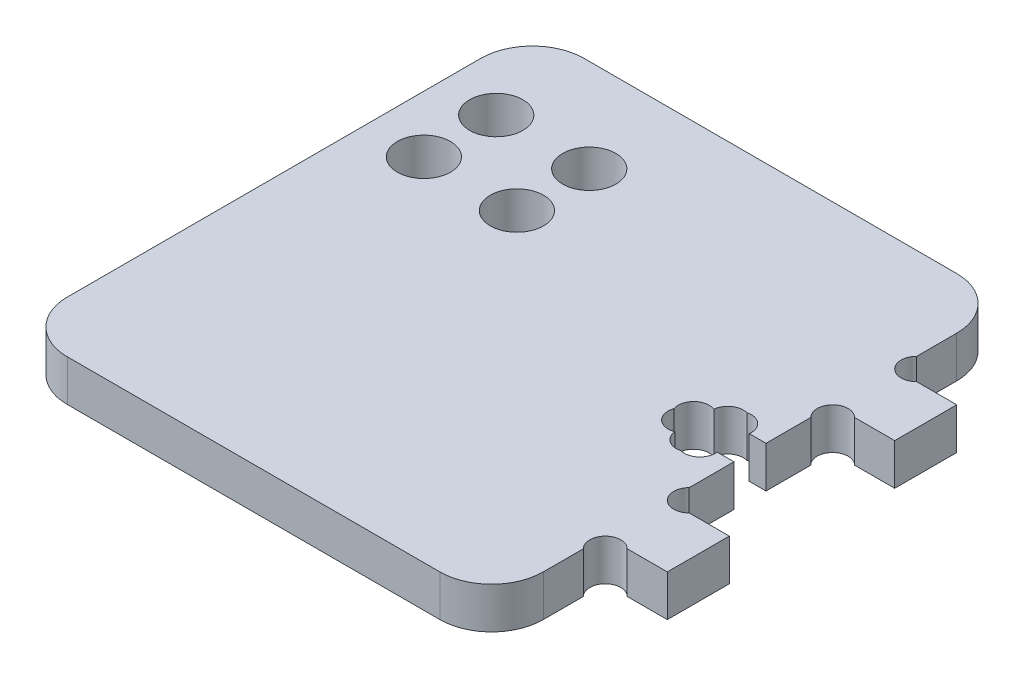
ISO-10303-21;
HEADER;
FILE_DESCRIPTION(('STEP AP214'),'2;1');
FILE_NAME('part.step','',(''),(''),'','','');
FILE_SCHEMA(('AUTOMOTIVE_DESIGN { 1 0 10303 214 1 1 1 1 }'));
ENDSEC;
DATA;
#1=APPLICATION_CONTEXT('core data for automotive mechanical design processes');
#2=APPLICATION_PROTOCOL_DEFINITION('international standard','automotive_design',2000,#1);
#3=PRODUCT_CONTEXT('',#1,'mechanical');
#4=PRODUCT('Part','Part','',(#3));
#5=PRODUCT_RELATED_PRODUCT_CATEGORY('part','',(#4));
#6=PRODUCT_DEFINITION_FORMATION('','',#4);
#7=PRODUCT_DEFINITION_CONTEXT('part definition',#1,'design');
#8=PRODUCT_DEFINITION('design','',#6,#7);
#9=PRODUCT_DEFINITION_SHAPE('','',#8);
#10=(LENGTH_UNIT() NAMED_UNIT(*) SI_UNIT(.MILLI.,.METRE.));
#11=(NAMED_UNIT(*) PLANE_ANGLE_UNIT() SI_UNIT($,.RADIAN.));
#12=(NAMED_UNIT(*) SI_UNIT($,.STERADIAN.) SOLID_ANGLE_UNIT());
#13=UNCERTAINTY_MEASURE_WITH_UNIT(LENGTH_MEASURE(1.E-05),#10,'distance_accuracy_value','');
#14=(GEOMETRIC_REPRESENTATION_CONTEXT(3) GLOBAL_UNCERTAINTY_ASSIGNED_CONTEXT((#13)) GLOBAL_UNIT_ASSIGNED_CONTEXT((#10,
#11,#12)) REPRESENTATION_CONTEXT('',''));
#15=CARTESIAN_POINT('',(0.,0.,0.));
#16=DIRECTION('',(0.,0.,1.));
#17=DIRECTION('',(1.,0.,0.));
#18=AXIS2_PLACEMENT_3D('',#15,#16,#17);
#19=CARTESIAN_POINT('',(-18.025,4.,20.));
#20=DIRECTION('',(0.,-1.,0.));
#21=DIRECTION('',(0.,0.,-1.));
#22=AXIS2_PLACEMENT_3D('',#19,#20,#21);
#23=CYLINDRICAL_SURFACE('',#22,5.);
#24=CARTESIAN_POINT('',(-18.025,0.,20.));
#25=DIRECTION('',(0.,1.,0.));
#26=DIRECTION('',(0.,0.,-1.));
#27=AXIS2_PLACEMENT_3D('',#24,#25,#26);
#28=CIRCLE('',#27,5.);
#29=CARTESIAN_POINT('',(-23.025,0.,20.));
#30=VERTEX_POINT('',#29);
#31=CARTESIAN_POINT('',(-18.025,0.,25.));
#32=VERTEX_POINT('',#31);
#33=EDGE_CURVE('E171',#30,#32,#28,.T.);
#34=ORIENTED_EDGE('',*,*,#33,.T.);
#35=DIRECTION('',(0.,-1.,0.));
#36=VECTOR('',#35,1.);
#37=CARTESIAN_POINT('',(-18.025,4.,25.));
#38=LINE('',#37,#36);
#39=CARTESIAN_POINT('',(-18.025,4.,25.));
#40=VERTEX_POINT('',#39);
#41=EDGE_CURVE('E244',#40,#32,#38,.T.);
#42=ORIENTED_EDGE('',*,*,#41,.F.);
#43=CARTESIAN_POINT('',(-18.025,4.,20.));
#44=DIRECTION('',(0.,1.,0.));
#45=DIRECTION('',(0.,0.,-1.));
#46=AXIS2_PLACEMENT_3D('',#43,#44,#45);
#47=CIRCLE('',#46,5.);
#48=CARTESIAN_POINT('',(-23.025,4.,20.));
#49=VERTEX_POINT('',#48);
#50=EDGE_CURVE('E213',#49,#40,#47,.T.);
#51=ORIENTED_EDGE('',*,*,#50,.F.);
#52=DIRECTION('',(0.,-1.,0.));
#53=VECTOR('',#52,1.);
#54=CARTESIAN_POINT('',(-23.025,4.,20.));
#55=LINE('',#54,#53);
#56=EDGE_CURVE('E167',#49,#30,#55,.T.);
#57=ORIENTED_EDGE('',*,*,#56,.T.);
#58=EDGE_LOOP('',(#34,#42,#51,#57));
#59=FACE_BOUND('',#58,.T.);
#60=ADVANCED_FACE('F33',(#59),#23,.T.);
#61=CARTESIAN_POINT('',(-18.025,4.,25.));
#62=DIRECTION('',(0.,0.,-1.));
#63=DIRECTION('',(-1.,0.,0.));
#64=AXIS2_PLACEMENT_3D('',#61,#62,#63);
#65=PLANE('',#64);
#66=DIRECTION('',(1.,0.,0.));
#67=VECTOR('',#66,1.);
#68=CARTESIAN_POINT('',(-18.025,0.,25.));
#69=LINE('',#68,#67);
#70=CARTESIAN_POINT('',(18.025,0.,25.));
#71=VERTEX_POINT('',#70);
#72=EDGE_CURVE('E174',#32,#71,#69,.T.);
#73=ORIENTED_EDGE('',*,*,#72,.T.);
#74=DIRECTION('',(0.,-1.,0.));
#75=VECTOR('',#74,1.);
#76=CARTESIAN_POINT('',(18.025,4.,25.));
#77=LINE('',#76,#75);
#78=CARTESIAN_POINT('',(18.025,4.,25.));
#79=VERTEX_POINT('',#78);
#80=EDGE_CURVE('E241',#79,#71,#77,.T.);
#81=ORIENTED_EDGE('',*,*,#80,.F.);
#82=DIRECTION('',(1.,0.,0.));
#83=VECTOR('',#82,1.);
#84=CARTESIAN_POINT('',(-18.025,4.,25.));
#85=LINE('',#84,#83);
#86=EDGE_CURVE('E112',#40,#79,#85,.T.);
#87=ORIENTED_EDGE('',*,*,#86,.F.);
#88=ORIENTED_EDGE('',*,*,#41,.T.);
#89=EDGE_LOOP('',(#73,#81,#87,#88));
#90=FACE_BOUND('',#89,.T.);
#91=ADVANCED_FACE('F367',(#90),#65,.F.);
#92=CARTESIAN_POINT('',(18.025,4.,20.));
#93=DIRECTION('',(0.,-1.,0.));
#94=DIRECTION('',(0.,0.,-1.));
#95=AXIS2_PLACEMENT_3D('',#92,#93,#94);
#96=CYLINDRICAL_SURFACE('',#95,5.);
#97=CARTESIAN_POINT('',(18.025,0.,20.));
#98=DIRECTION('',(0.,1.,0.));
#99=DIRECTION('',(0.,0.,1.));
#100=AXIS2_PLACEMENT_3D('',#97,#98,#99);
#101=CIRCLE('',#100,5.);
#102=CARTESIAN_POINT('',(23.025,0.,20.));
#103=VERTEX_POINT('',#102);
#104=EDGE_CURVE('E177',#71,#103,#101,.T.);
#105=ORIENTED_EDGE('',*,*,#104,.T.);
#106=DIRECTION('',(0.,-1.,0.));
#107=VECTOR('',#106,1.);
#108=CARTESIAN_POINT('',(23.025,4.,20.));
#109=LINE('',#108,#107);
#110=CARTESIAN_POINT('',(23.025,4.,20.));
#111=VERTEX_POINT('',#110);
#112=EDGE_CURVE('E238',#111,#103,#109,.T.);
#113=ORIENTED_EDGE('',*,*,#112,.F.);
#114=CARTESIAN_POINT('',(18.025,4.,20.));
#115=DIRECTION('',(0.,1.,0.));
#116=DIRECTION('',(0.,0.,1.));
#117=AXIS2_PLACEMENT_3D('',#114,#115,#116);
#118=CIRCLE('',#117,5.);
#119=EDGE_CURVE('E745',#79,#111,#118,.T.);
#120=ORIENTED_EDGE('',*,*,#119,.F.);
#121=ORIENTED_EDGE('',*,*,#80,.T.);
#122=EDGE_LOOP('',(#105,#113,#120,#121));
#123=FACE_BOUND('',#122,.T.);
#124=ADVANCED_FACE('F371',(#123),#96,.T.);
#125=CARTESIAN_POINT('',(23.025,4.,20.));
#126=DIRECTION('',(-1.,0.,0.));
#127=DIRECTION('',(0.,0.,1.));
#128=AXIS2_PLACEMENT_3D('',#125,#126,#127);
#129=PLANE('',#128);
#130=DIRECTION('',(0.,0.,-1.));
#131=VECTOR('',#130,1.);
#132=CARTESIAN_POINT('',(23.025,0.,20.));
#133=LINE('',#132,#131);
#134=CARTESIAN_POINT('',(23.025,0.,16.1213203435597));
#135=VERTEX_POINT('',#134);
#136=EDGE_CURVE('E179',#103,#135,#133,.T.);
#137=ORIENTED_EDGE('',*,*,#136,.T.);
#138=DIRECTION('',(0.,1.,0.));
#139=VECTOR('',#138,1.);
#140=CARTESIAN_POINT('',(23.025,0.,16.1213203435597));
#141=LINE('',#140,#139);
#142=CARTESIAN_POINT('',(23.025,4.,16.1213203435597));
#143=VERTEX_POINT('',#142);
#144=EDGE_CURVE('E283',#135,#143,#141,.T.);
#145=ORIENTED_EDGE('',*,*,#144,.T.);
#146=DIRECTION('',(0.,0.,-1.));
#147=VECTOR('',#146,1.);
#148=CARTESIAN_POINT('',(23.025,4.,20.));
#149=LINE('',#148,#147);
#150=EDGE_CURVE('E747',#111,#143,#149,.T.);
#151=ORIENTED_EDGE('',*,*,#150,.F.);
#152=ORIENTED_EDGE('',*,*,#112,.T.);
#153=EDGE_LOOP('',(#137,#145,#151,#152));
#154=FACE_BOUND('',#153,.T.);
#155=ADVANCED_FACE('F375',(#154),#129,.F.);
#156=CARTESIAN_POINT('',(23.025,4.,14.));
#157=DIRECTION('',(0.,0.,-1.));
#158=DIRECTION('',(-1.,0.,0.));
#159=AXIS2_PLACEMENT_3D('',#156,#157,#158);
#160=PLANE('',#159);
#161=DIRECTION('',(1.,0.,0.));
#162=VECTOR('',#161,1.);
#163=CARTESIAN_POINT('',(23.025,4.,14.));
#164=LINE('',#163,#162);
#165=CARTESIAN_POINT('',(25.1463203435596,4.,14.));
#166=VERTEX_POINT('',#165);
#167=CARTESIAN_POINT('',(29.025,4.,14.));
#168=VERTEX_POINT('',#167);
#169=EDGE_CURVE('E292',#166,#168,#164,.T.);
#170=ORIENTED_EDGE('',*,*,#169,.F.);
#171=DIRECTION('',(0.,1.,0.));
#172=VECTOR('',#171,1.);
#173=CARTESIAN_POINT('',(25.1463203435596,0.,14.));
#174=LINE('',#173,#172);
#175=CARTESIAN_POINT('',(25.1463203435596,0.,14.));
#176=VERTEX_POINT('',#175);
#177=EDGE_CURVE('E279',#166,#176,#174,.F.);
#178=ORIENTED_EDGE('',*,*,#177,.T.);
#179=DIRECTION('',(1.,0.,0.));
#180=VECTOR('',#179,1.);
#181=CARTESIAN_POINT('',(23.025,0.,14.));
#182=LINE('',#181,#180);
#183=CARTESIAN_POINT('',(29.025,0.,14.));
#184=VERTEX_POINT('',#183);
#185=EDGE_CURVE('E182',#176,#184,#182,.T.);
#186=ORIENTED_EDGE('',*,*,#185,.T.);
#187=DIRECTION('',(0.,-1.,0.));
#188=VECTOR('',#187,1.);
#189=CARTESIAN_POINT('',(29.025,4.,14.));
#190=LINE('',#189,#188);
#191=EDGE_CURVE('E235',#168,#184,#190,.T.);
#192=ORIENTED_EDGE('',*,*,#191,.F.);
#193=EDGE_LOOP('',(#170,#178,#186,#192));
#194=FACE_BOUND('',#193,.T.);
#195=ADVANCED_FACE('F290',(#194),#160,.F.);
#196=CARTESIAN_POINT('',(29.025,4.,8.));
#197=DIRECTION('',(-1.,0.,0.));
#198=DIRECTION('',(0.,0.,1.));
#199=AXIS2_PLACEMENT_3D('',#196,#197,#198);
#200=PLANE('',#199);
#201=DIRECTION('',(0.,0.,-1.));
#202=VECTOR('',#201,1.);
#203=CARTESIAN_POINT('',(29.025,0.,8.));
#204=LINE('',#203,#202);
#205=CARTESIAN_POINT('',(29.025,0.,8.));
#206=VERTEX_POINT('',#205);
#207=EDGE_CURVE('E184',#184,#206,#204,.T.);
#208=ORIENTED_EDGE('',*,*,#207,.T.);
#209=DIRECTION('',(0.,-1.,0.));
#210=VECTOR('',#209,1.);
#211=CARTESIAN_POINT('',(29.025,4.,8.));
#212=LINE('',#211,#210);
#213=CARTESIAN_POINT('',(29.025,4.,8.));
#214=VERTEX_POINT('',#213);
#215=EDGE_CURVE('E232',#214,#206,#212,.T.);
#216=ORIENTED_EDGE('',*,*,#215,.F.);
#217=DIRECTION('',(0.,0.,-1.));
#218=VECTOR('',#217,1.);
#219=CARTESIAN_POINT('',(29.025,4.,8.));
#220=LINE('',#219,#218);
#221=EDGE_CURVE('E314',#168,#214,#220,.T.);
#222=ORIENTED_EDGE('',*,*,#221,.F.);
#223=ORIENTED_EDGE('',*,*,#191,.T.);
#224=EDGE_LOOP('',(#208,#216,#222,#223));
#225=FACE_BOUND('',#224,.T.);
#226=ADVANCED_FACE('F301',(#225),#200,.F.);
#227=CARTESIAN_POINT('',(23.025,4.,8.00000000000001));
#228=DIRECTION('',(0.,0.,1.));
#229=DIRECTION('',(1.,0.,0.));
#230=AXIS2_PLACEMENT_3D('',#227,#228,#229);
#231=PLANE('',#230);
#232=DIRECTION('',(-1.,0.,0.));
#233=VECTOR('',#232,1.);
#234=CARTESIAN_POINT('',(23.025,0.,8.00000000000001));
#235=LINE('',#234,#233);
#236=CARTESIAN_POINT('',(25.1463203435596,0.,8.00000000000001));
#237=VERTEX_POINT('',#236);
#238=EDGE_CURVE('E186',#206,#237,#235,.T.);
#239=ORIENTED_EDGE('',*,*,#238,.T.);
#240=DIRECTION('',(0.,1.,0.));
#241=VECTOR('',#240,1.);
#242=CARTESIAN_POINT('',(25.1463203435596,0.,8.00000000000001));
#243=LINE('',#242,#241);
#244=CARTESIAN_POINT('',(25.1463203435596,4.,8.00000000000001));
#245=VERTEX_POINT('',#244);
#246=EDGE_CURVE('E311',#237,#245,#243,.T.);
#247=ORIENTED_EDGE('',*,*,#246,.T.);
#248=DIRECTION('',(-1.,0.,0.));
#249=VECTOR('',#248,1.);
#250=CARTESIAN_POINT('',(23.025,4.,8.00000000000001));
#251=LINE('',#250,#249);
#252=EDGE_CURVE('E308',#214,#245,#251,.T.);
#253=ORIENTED_EDGE('',*,*,#252,.F.);
#254=ORIENTED_EDGE('',*,*,#215,.T.);
#255=EDGE_LOOP('',(#239,#247,#253,#254));
#256=FACE_BOUND('',#255,.T.);
#257=ADVANCED_FACE('F305',(#256),#231,.F.);
#258=CARTESIAN_POINT('',(23.025,4.,8.00000000000001));
#259=DIRECTION('',(-1.,0.,0.));
#260=DIRECTION('',(0.,0.,1.));
#261=AXIS2_PLACEMENT_3D('',#258,#259,#260);
#262=PLANE('',#261);
#263=DIRECTION('',(0.,0.,-1.));
#264=VECTOR('',#263,1.);
#265=CARTESIAN_POINT('',(23.025,4.,8.00000000000001));
#266=LINE('',#265,#264);
#267=CARTESIAN_POINT('',(23.025,4.,5.87867965644035));
#268=VERTEX_POINT('',#267);
#269=CARTESIAN_POINT('',(23.025,4.,1.55));
#270=VERTEX_POINT('',#269);
#271=EDGE_CURVE('E313',#268,#270,#266,.T.);
#272=ORIENTED_EDGE('',*,*,#271,.F.);
#273=DIRECTION('',(0.,1.,0.));
#274=VECTOR('',#273,1.);
#275=CARTESIAN_POINT('',(23.025,0.,5.87867965644035));
#276=LINE('',#275,#274);
#277=CARTESIAN_POINT('',(23.025,0.,5.87867965644035));
#278=VERTEX_POINT('',#277);
#279=EDGE_CURVE('E684',#268,#278,#276,.F.);
#280=ORIENTED_EDGE('',*,*,#279,.T.);
#281=DIRECTION('',(0.,0.,-1.));
#282=VECTOR('',#281,1.);
#283=CARTESIAN_POINT('',(23.025,0.,8.00000000000001));
#284=LINE('',#283,#282);
#285=CARTESIAN_POINT('',(23.025,0.,1.55));
#286=VERTEX_POINT('',#285);
#287=EDGE_CURVE('E189',#278,#286,#284,.T.);
#288=ORIENTED_EDGE('',*,*,#287,.T.);
#289=DIRECTION('',(0.,-1.,0.));
#290=VECTOR('',#289,1.);
#291=CARTESIAN_POINT('',(23.025,4.,1.55));
#292=LINE('',#291,#290);
#293=EDGE_CURVE('E229',#270,#286,#292,.T.);
#294=ORIENTED_EDGE('',*,*,#293,.F.);
#295=EDGE_LOOP('',(#272,#280,#288,#294));
#296=FACE_BOUND('',#295,.T.);
#297=ADVANCED_FACE('F388',(#296),#262,.F.);
#298=CARTESIAN_POINT('',(20.975,4.,1.55));
#299=DIRECTION('',(0.,0.,1.));
#300=DIRECTION('',(1.,0.,0.));
#301=AXIS2_PLACEMENT_3D('',#298,#299,#300);
#302=PLANE('',#301);
#303=DIRECTION('',(-1.,0.,0.));
#304=VECTOR('',#303,1.);
#305=CARTESIAN_POINT('',(20.975,0.,1.55));
#306=LINE('',#305,#304);
#307=CARTESIAN_POINT('',(21.4023419886519,0.,1.55));
#308=VERTEX_POINT('',#307);
#309=EDGE_CURVE('E191',#286,#308,#306,.T.);
#310=ORIENTED_EDGE('',*,*,#309,.T.);
#311=DIRECTION('',(0.,1.,0.));
#312=VECTOR('',#311,1.);
#313=CARTESIAN_POINT('',(21.4023419886519,0.,1.55));
#314=LINE('',#313,#312);
#315=CARTESIAN_POINT('',(21.4023419886519,4.,1.55));
#316=VERTEX_POINT('',#315);
#317=EDGE_CURVE('E726',#308,#316,#314,.T.);
#318=ORIENTED_EDGE('',*,*,#317,.T.);
#319=DIRECTION('',(-1.,0.,0.));
#320=VECTOR('',#319,1.);
#321=CARTESIAN_POINT('',(20.975,4.,1.55));
#322=LINE('',#321,#320);
#323=EDGE_CURVE('E316',#270,#316,#322,.T.);
#324=ORIENTED_EDGE('',*,*,#323,.F.);
#325=ORIENTED_EDGE('',*,*,#293,.T.);
#326=EDGE_LOOP('',(#310,#318,#324,#325));
#327=FACE_BOUND('',#326,.T.);
#328=ADVANCED_FACE('F391',(#327),#302,.F.);
#329=CARTESIAN_POINT('',(20.975,4.,-1.54999999999999));
#330=DIRECTION('',(0.,0.,-1.));
#331=DIRECTION('',(-1.,0.,0.));
#332=AXIS2_PLACEMENT_3D('',#329,#330,#331);
#333=PLANE('',#332);
#334=DIRECTION('',(1.,0.,0.));
#335=VECTOR('',#334,1.);
#336=CARTESIAN_POINT('',(20.975,4.,-1.54999999999999));
#337=LINE('',#336,#335);
#338=CARTESIAN_POINT('',(21.4023419886519,4.,-1.54999999999999));
#339=VERTEX_POINT('',#338);
#340=CARTESIAN_POINT('',(23.025,4.,-1.54999999999999));
#341=VERTEX_POINT('',#340);
#342=EDGE_CURVE('E323',#339,#341,#337,.T.);
#343=ORIENTED_EDGE('',*,*,#342,.F.);
#344=DIRECTION('',(0.,1.,0.));
#345=VECTOR('',#344,1.);
#346=CARTESIAN_POINT('',(21.4023419886519,0.,-1.54999999999999));
#347=LINE('',#346,#345);
#348=CARTESIAN_POINT('',(21.4023419886519,0.,-1.54999999999999));
#349=VERTEX_POINT('',#348);
#350=EDGE_CURVE('E175',#349,#339,#347,.T.);
#351=ORIENTED_EDGE('',*,*,#350,.F.);
#352=DIRECTION('',(1.,0.,0.));
#353=VECTOR('',#352,1.);
#354=CARTESIAN_POINT('',(20.975,0.,-1.54999999999999));
#355=LINE('',#354,#353);
#356=CARTESIAN_POINT('',(23.025,0.,-1.54999999999999));
#357=VERTEX_POINT('',#356);
#358=EDGE_CURVE('E194',#349,#357,#355,.T.);
#359=ORIENTED_EDGE('',*,*,#358,.T.);
#360=DIRECTION('',(0.,-1.,0.));
#361=VECTOR('',#360,1.);
#362=CARTESIAN_POINT('',(23.025,4.,-1.54999999999999));
#363=LINE('',#362,#361);
#364=EDGE_CURVE('E226',#341,#357,#363,.T.);
#365=ORIENTED_EDGE('',*,*,#364,.F.);
#366=EDGE_LOOP('',(#343,#351,#359,#365));
#367=FACE_BOUND('',#366,.T.);
#368=ADVANCED_FACE('F395',(#367),#333,.F.);
#369=CARTESIAN_POINT('',(23.025,4.,-1.54999999999999));
#370=DIRECTION('',(-1.,0.,0.));
#371=DIRECTION('',(0.,0.,1.));
#372=AXIS2_PLACEMENT_3D('',#369,#370,#371);
#373=PLANE('',#372);
#374=DIRECTION('',(0.,0.,-1.));
#375=VECTOR('',#374,1.);
#376=CARTESIAN_POINT('',(23.025,0.,-1.54999999999999));
#377=LINE('',#376,#375);
#378=CARTESIAN_POINT('',(23.025,0.,-5.87867965644035));
#379=VERTEX_POINT('',#378);
#380=EDGE_CURVE('E196',#357,#379,#377,.T.);
#381=ORIENTED_EDGE('',*,*,#380,.T.);
#382=DIRECTION('',(0.,1.,0.));
#383=VECTOR('',#382,1.);
#384=CARTESIAN_POINT('',(23.025,0.,-5.87867965644035));
#385=LINE('',#384,#383);
#386=CARTESIAN_POINT('',(23.025,4.,-5.87867965644035));
#387=VERTEX_POINT('',#386);
#388=EDGE_CURVE('E696',#379,#387,#385,.T.);
#389=ORIENTED_EDGE('',*,*,#388,.T.);
#390=DIRECTION('',(0.,0.,-1.));
#391=VECTOR('',#390,1.);
#392=CARTESIAN_POINT('',(23.025,4.,-1.54999999999999));
#393=LINE('',#392,#391);
#394=EDGE_CURVE('E325',#341,#387,#393,.T.);
#395=ORIENTED_EDGE('',*,*,#394,.F.);
#396=ORIENTED_EDGE('',*,*,#364,.T.);
#397=EDGE_LOOP('',(#381,#389,#395,#396));
#398=FACE_BOUND('',#397,.T.);
#399=ADVANCED_FACE('F399',(#398),#373,.F.);
#400=CARTESIAN_POINT('',(23.025,4.,-8.00000000000001));
#401=DIRECTION('',(0.,0.,-1.));
#402=DIRECTION('',(-1.,0.,0.));
#403=AXIS2_PLACEMENT_3D('',#400,#401,#402);
#404=PLANE('',#403);
#405=DIRECTION('',(1.,0.,0.));
#406=VECTOR('',#405,1.);
#407=CARTESIAN_POINT('',(23.025,4.,-8.00000000000001));
#408=LINE('',#407,#406);
#409=CARTESIAN_POINT('',(25.1463203435596,4.,-8.00000000000001));
#410=VERTEX_POINT('',#409);
#411=CARTESIAN_POINT('',(29.025,4.,-8.));
#412=VERTEX_POINT('',#411);
#413=EDGE_CURVE('E328',#410,#412,#408,.T.);
#414=ORIENTED_EDGE('',*,*,#413,.F.);
#415=DIRECTION('',(0.,1.,0.));
#416=VECTOR('',#415,1.);
#417=CARTESIAN_POINT('',(25.1463203435596,0.,-8.00000000000001));
#418=LINE('',#417,#416);
#419=CARTESIAN_POINT('',(25.1463203435596,0.,-8.00000000000001));
#420=VERTEX_POINT('',#419);
#421=EDGE_CURVE('E693',#410,#420,#418,.F.);
#422=ORIENTED_EDGE('',*,*,#421,.T.);
#423=DIRECTION('',(1.,0.,0.));
#424=VECTOR('',#423,1.);
#425=CARTESIAN_POINT('',(23.025,0.,-8.00000000000001));
#426=LINE('',#425,#424);
#427=CARTESIAN_POINT('',(29.025,0.,-8.));
#428=VERTEX_POINT('',#427);
#429=EDGE_CURVE('E199',#420,#428,#426,.T.);
#430=ORIENTED_EDGE('',*,*,#429,.T.);
#431=DIRECTION('',(0.,-1.,0.));
#432=VECTOR('',#431,1.);
#433=CARTESIAN_POINT('',(29.025,4.,-8.));
#434=LINE('',#433,#432);
#435=EDGE_CURVE('E223',#412,#428,#434,.T.);
#436=ORIENTED_EDGE('',*,*,#435,.F.);
#437=EDGE_LOOP('',(#414,#422,#430,#436));
#438=FACE_BOUND('',#437,.T.);
#439=ADVANCED_FACE('F403',(#438),#404,.F.);
#440=CARTESIAN_POINT('',(29.025,4.,-14.));
#441=DIRECTION('',(-1.,0.,0.));
#442=DIRECTION('',(0.,0.,1.));
#443=AXIS2_PLACEMENT_3D('',#440,#441,#442);
#444=PLANE('',#443);
#445=DIRECTION('',(0.,0.,-1.));
#446=VECTOR('',#445,1.);
#447=CARTESIAN_POINT('',(29.025,0.,-14.));
#448=LINE('',#447,#446);
#449=CARTESIAN_POINT('',(29.025,0.,-14.));
#450=VERTEX_POINT('',#449);
#451=EDGE_CURVE('E201',#428,#450,#448,.T.);
#452=ORIENTED_EDGE('',*,*,#451,.T.);
#453=DIRECTION('',(0.,-1.,0.));
#454=VECTOR('',#453,1.);
#455=CARTESIAN_POINT('',(29.025,4.,-14.));
#456=LINE('',#455,#454);
#457=CARTESIAN_POINT('',(29.025,4.,-14.));
#458=VERTEX_POINT('',#457);
#459=EDGE_CURVE('E220',#458,#450,#456,.T.);
#460=ORIENTED_EDGE('',*,*,#459,.F.);
#461=DIRECTION('',(0.,0.,-1.));
#462=VECTOR('',#461,1.);
#463=CARTESIAN_POINT('',(29.025,4.,-14.));
#464=LINE('',#463,#462);
#465=EDGE_CURVE('E330',#412,#458,#464,.T.);
#466=ORIENTED_EDGE('',*,*,#465,.F.);
#467=ORIENTED_EDGE('',*,*,#435,.T.);
#468=EDGE_LOOP('',(#452,#460,#466,#467));
#469=FACE_BOUND('',#468,.T.);
#470=ADVANCED_FACE('F407',(#469),#444,.F.);
#471=CARTESIAN_POINT('',(23.025,4.,-14.));
#472=DIRECTION('',(0.,0.,1.));
#473=DIRECTION('',(1.,0.,0.));
#474=AXIS2_PLACEMENT_3D('',#471,#472,#473);
#475=PLANE('',#474);
#476=DIRECTION('',(-1.,0.,0.));
#477=VECTOR('',#476,1.);
#478=CARTESIAN_POINT('',(23.025,0.,-14.));
#479=LINE('',#478,#477);
#480=CARTESIAN_POINT('',(25.1463203435596,0.,-14.));
#481=VERTEX_POINT('',#480);
#482=EDGE_CURVE('E203',#450,#481,#479,.T.);
#483=ORIENTED_EDGE('',*,*,#482,.T.);
#484=DIRECTION('',(0.,1.,0.));
#485=VECTOR('',#484,1.);
#486=CARTESIAN_POINT('',(25.1463203435596,0.,-14.));
#487=LINE('',#486,#485);
#488=CARTESIAN_POINT('',(25.1463203435596,4.,-14.));
#489=VERTEX_POINT('',#488);
#490=EDGE_CURVE('E702',#481,#489,#487,.T.);
#491=ORIENTED_EDGE('',*,*,#490,.T.);
#492=DIRECTION('',(-1.,0.,0.));
#493=VECTOR('',#492,1.);
#494=CARTESIAN_POINT('',(23.025,4.,-14.));
#495=LINE('',#494,#493);
#496=EDGE_CURVE('E332',#458,#489,#495,.T.);
#497=ORIENTED_EDGE('',*,*,#496,.F.);
#498=ORIENTED_EDGE('',*,*,#459,.T.);
#499=EDGE_LOOP('',(#483,#491,#497,#498));
#500=FACE_BOUND('',#499,.T.);
#501=ADVANCED_FACE('F411',(#500),#475,.F.);
#502=CARTESIAN_POINT('',(23.025,4.,-14.));
#503=DIRECTION('',(-1.,0.,0.));
#504=DIRECTION('',(0.,0.,1.));
#505=AXIS2_PLACEMENT_3D('',#502,#503,#504);
#506=PLANE('',#505);
#507=DIRECTION('',(0.,0.,-1.));
#508=VECTOR('',#507,1.);
#509=CARTESIAN_POINT('',(23.025,4.,-14.));
#510=LINE('',#509,#508);
#511=CARTESIAN_POINT('',(23.025,4.,-16.1213203435597));
#512=VERTEX_POINT('',#511);
#513=CARTESIAN_POINT('',(23.025,4.,-20.));
#514=VERTEX_POINT('',#513);
#515=EDGE_CURVE('E335',#512,#514,#510,.T.);
#516=ORIENTED_EDGE('',*,*,#515,.F.);
#517=DIRECTION('',(0.,1.,0.));
#518=VECTOR('',#517,1.);
#519=CARTESIAN_POINT('',(23.025,0.,-16.1213203435597));
#520=LINE('',#519,#518);
#521=CARTESIAN_POINT('',(23.025,0.,-16.1213203435597));
#522=VERTEX_POINT('',#521);
#523=EDGE_CURVE('E700',#512,#522,#520,.F.);
#524=ORIENTED_EDGE('',*,*,#523,.T.);
#525=DIRECTION('',(0.,0.,-1.));
#526=VECTOR('',#525,1.);
#527=CARTESIAN_POINT('',(23.025,0.,-14.));
#528=LINE('',#527,#526);
#529=CARTESIAN_POINT('',(23.025,0.,-20.));
#530=VERTEX_POINT('',#529);
#531=EDGE_CURVE('E206',#522,#530,#528,.T.);
#532=ORIENTED_EDGE('',*,*,#531,.T.);
#533=DIRECTION('',(0.,-1.,0.));
#534=VECTOR('',#533,1.);
#535=CARTESIAN_POINT('',(23.025,4.,-20.));
#536=LINE('',#535,#534);
#537=EDGE_CURVE('E217',#514,#530,#536,.T.);
#538=ORIENTED_EDGE('',*,*,#537,.F.);
#539=EDGE_LOOP('',(#516,#524,#532,#538));
#540=FACE_BOUND('',#539,.T.);
#541=ADVANCED_FACE('F345',(#540),#506,.F.);
#542=CARTESIAN_POINT('',(18.025,4.,-20.));
#543=DIRECTION('',(0.,-1.,0.));
#544=DIRECTION('',(0.,0.,-1.));
#545=AXIS2_PLACEMENT_3D('',#542,#543,#544);
#546=CYLINDRICAL_SURFACE('',#545,5.);
#547=CARTESIAN_POINT('',(18.025,0.,-20.));
#548=DIRECTION('',(0.,1.,0.));
#549=DIRECTION('',(0.,0.,-1.));
#550=AXIS2_PLACEMENT_3D('',#547,#548,#549);
#551=CIRCLE('',#550,5.);
#552=CARTESIAN_POINT('',(18.025,0.,-25.));
#553=VERTEX_POINT('',#552);
#554=EDGE_CURVE('E208',#530,#553,#551,.T.);
#555=ORIENTED_EDGE('',*,*,#554,.T.);
#556=DIRECTION('',(0.,-1.,0.));
#557=VECTOR('',#556,1.);
#558=CARTESIAN_POINT('',(18.025,4.,-25.));
#559=LINE('',#558,#557);
#560=CARTESIAN_POINT('',(18.025,4.,-25.));
#561=VERTEX_POINT('',#560);
#562=EDGE_CURVE('E162',#561,#553,#559,.T.);
#563=ORIENTED_EDGE('',*,*,#562,.F.);
#564=CARTESIAN_POINT('',(18.025,4.,-20.));
#565=DIRECTION('',(0.,1.,0.));
#566=DIRECTION('',(0.,0.,-1.));
#567=AXIS2_PLACEMENT_3D('',#564,#565,#566);
#568=CIRCLE('',#567,5.);
#569=EDGE_CURVE('E153',#514,#561,#568,.T.);
#570=ORIENTED_EDGE('',*,*,#569,.F.);
#571=ORIENTED_EDGE('',*,*,#537,.T.);
#572=EDGE_LOOP('',(#555,#563,#570,#571));
#573=FACE_BOUND('',#572,.T.);
#574=ADVANCED_FACE('F349',(#573),#546,.T.);
#575=CARTESIAN_POINT('',(-18.025,4.,-25.));
#576=DIRECTION('',(0.,0.,1.));
#577=DIRECTION('',(1.,0.,0.));
#578=AXIS2_PLACEMENT_3D('',#575,#576,#577);
#579=PLANE('',#578);
#580=DIRECTION('',(-1.,0.,0.));
#581=VECTOR('',#580,1.);
#582=CARTESIAN_POINT('',(-18.025,0.,-25.));
#583=LINE('',#582,#581);
#584=CARTESIAN_POINT('',(-18.025,0.,-25.));
#585=VERTEX_POINT('',#584);
#586=EDGE_CURVE('E161',#553,#585,#583,.T.);
#587=ORIENTED_EDGE('',*,*,#586,.T.);
#588=DIRECTION('',(0.,-1.,0.));
#589=VECTOR('',#588,1.);
#590=CARTESIAN_POINT('',(-18.025,4.,-25.));
#591=LINE('',#590,#589);
#592=CARTESIAN_POINT('',(-18.025,4.,-25.));
#593=VERTEX_POINT('',#592);
#594=EDGE_CURVE('E158',#593,#585,#591,.T.);
#595=ORIENTED_EDGE('',*,*,#594,.F.);
#596=DIRECTION('',(-1.,0.,0.));
#597=VECTOR('',#596,1.);
#598=CARTESIAN_POINT('',(-18.025,4.,-25.));
#599=LINE('',#598,#597);
#600=EDGE_CURVE('E146',#561,#593,#599,.T.);
#601=ORIENTED_EDGE('',*,*,#600,.F.);
#602=ORIENTED_EDGE('',*,*,#562,.T.);
#603=EDGE_LOOP('',(#587,#595,#601,#602));
#604=FACE_BOUND('',#603,.T.);
#605=ADVANCED_FACE('F159',(#604),#579,.F.);
#606=CARTESIAN_POINT('',(-18.025,4.,-20.));
#607=DIRECTION('',(0.,-1.,0.));
#608=DIRECTION('',(0.,0.,-1.));
#609=AXIS2_PLACEMENT_3D('',#606,#607,#608);
#610=CYLINDRICAL_SURFACE('',#609,5.);
#611=CARTESIAN_POINT('',(-18.025,0.,-20.));
#612=DIRECTION('',(0.,1.,0.));
#613=DIRECTION('',(0.,0.,-1.));
#614=AXIS2_PLACEMENT_3D('',#611,#612,#613);
#615=CIRCLE('',#614,5.);
#616=CARTESIAN_POINT('',(-23.025,0.,-20.));
#617=VERTEX_POINT('',#616);
#618=EDGE_CURVE('E97',#585,#617,#615,.T.);
#619=ORIENTED_EDGE('',*,*,#618,.T.);
#620=DIRECTION('',(0.,-1.,0.));
#621=VECTOR('',#620,1.);
#622=CARTESIAN_POINT('',(-23.025,4.,-20.));
#623=LINE('',#622,#621);
#624=CARTESIAN_POINT('',(-23.025,4.,-20.));
#625=VERTEX_POINT('',#624);
#626=EDGE_CURVE('E163',#625,#617,#623,.T.);
#627=ORIENTED_EDGE('',*,*,#626,.F.);
#628=CARTESIAN_POINT('',(-18.025,4.,-20.));
#629=DIRECTION('',(0.,1.,0.));
#630=DIRECTION('',(0.,0.,-1.));
#631=AXIS2_PLACEMENT_3D('',#628,#629,#630);
#632=CIRCLE('',#631,5.);
#633=EDGE_CURVE('E151',#593,#625,#632,.T.);
#634=ORIENTED_EDGE('',*,*,#633,.F.);
#635=ORIENTED_EDGE('',*,*,#594,.T.);
#636=EDGE_LOOP('',(#619,#627,#634,#635));
#637=FACE_BOUND('',#636,.T.);
#638=ADVANCED_FACE('F165',(#637),#610,.T.);
#639=CARTESIAN_POINT('',(-23.025,4.,20.));
#640=DIRECTION('',(1.,0.,0.));
#641=DIRECTION('',(0.,0.,-1.));
#642=AXIS2_PLACEMENT_3D('',#639,#640,#641);
#643=PLANE('',#642);
#644=DIRECTION('',(0.,0.,1.));
#645=VECTOR('',#644,1.);
#646=CARTESIAN_POINT('',(-23.025,0.,20.));
#647=LINE('',#646,#645);
#648=EDGE_CURVE('E103',#617,#30,#647,.T.);
#649=ORIENTED_EDGE('',*,*,#648,.T.);
#650=ORIENTED_EDGE('',*,*,#56,.F.);
#651=DIRECTION('',(0.,0.,1.));
#652=VECTOR('',#651,1.);
#653=CARTESIAN_POINT('',(-23.025,4.,20.));
#654=LINE('',#653,#652);
#655=EDGE_CURVE('E49',#625,#49,#654,.T.);
#656=ORIENTED_EDGE('',*,*,#655,.F.);
#657=ORIENTED_EDGE('',*,*,#626,.T.);
#658=EDGE_LOOP('',(#649,#650,#656,#657));
#659=FACE_BOUND('',#658,.T.);
#660=ADVANCED_FACE('F355',(#659),#643,.F.);
#661=CARTESIAN_POINT('',(-18.025,4.,20.));
#662=DIRECTION('',(0.,-1.,0.));
#663=DIRECTION('',(0.,0.,-1.));
#664=AXIS2_PLACEMENT_3D('',#661,#662,#663);
#665=PLANE('',#664);
#666=CARTESIAN_POINT('',(-17.525,4.,-9.00000000000002));
#667=DIRECTION('',(0.,1.,0.));
#668=DIRECTION('',(0.,0.,1.));
#669=AXIS2_PLACEMENT_3D('',#666,#667,#668);
#670=CIRCLE('',#669,2.575);
#671=CARTESIAN_POINT('',(-17.525,4.,-6.42500000000002));
#672=VERTEX_POINT('',#671);
#673=EDGE_CURVE('E659',#672,#672,#670,.T.);
#674=ORIENTED_EDGE('',*,*,#673,.F.);
#675=EDGE_LOOP('',(#674));
#676=FACE_BOUND('',#675,.T.);
#677=CARTESIAN_POINT('',(-8.525,4.,-9.00000000000002));
#678=DIRECTION('',(0.,1.,0.));
#679=DIRECTION('',(0.,0.,1.));
#680=AXIS2_PLACEMENT_3D('',#677,#678,#679);
#681=CIRCLE('',#680,2.575);
#682=CARTESIAN_POINT('',(-8.525,4.,-6.42500000000002));
#683=VERTEX_POINT('',#682);
#684=EDGE_CURVE('E661',#683,#683,#681,.T.);
#685=ORIENTED_EDGE('',*,*,#684,.F.);
#686=EDGE_LOOP('',(#685));
#687=FACE_BOUND('',#686,.T.);
#688=CARTESIAN_POINT('',(-8.525,4.,-16.));
#689=DIRECTION('',(0.,1.,0.));
#690=DIRECTION('',(0.,0.,1.));
#691=AXIS2_PLACEMENT_3D('',#688,#689,#690);
#692=CIRCLE('',#691,2.575);
#693=CARTESIAN_POINT('',(-8.525,4.,-13.425));
#694=VERTEX_POINT('',#693);
#695=EDGE_CURVE('E667',#694,#694,#692,.T.);
#696=ORIENTED_EDGE('',*,*,#695,.F.);
#697=EDGE_LOOP('',(#696));
#698=FACE_BOUND('',#697,.T.);
#699=CARTESIAN_POINT('',(-17.525,4.,-16.));
#700=DIRECTION('',(0.,1.,0.));
#701=DIRECTION('',(0.,0.,1.));
#702=AXIS2_PLACEMENT_3D('',#699,#700,#701);
#703=CIRCLE('',#702,2.575);
#704=CARTESIAN_POINT('',(-17.525,4.,-13.425));
#705=VERTEX_POINT('',#704);
#706=EDGE_CURVE('E673',#705,#705,#703,.T.);
#707=ORIENTED_EDGE('',*,*,#706,.F.);
#708=EDGE_LOOP('',(#707));
#709=FACE_BOUND('',#708,.T.);
#710=ORIENTED_EDGE('',*,*,#252,.T.);
#711=CARTESIAN_POINT('',(24.0856601717798,4.,6.93933982822019));
#712=DIRECTION('',(0.,1.,0.));
#713=DIRECTION('',(0.,0.,-1.));
#714=AXIS2_PLACEMENT_3D('',#711,#712,#713);
#715=CIRCLE('',#714,1.5);
#716=EDGE_CURVE('E679',#268,#245,#715,.T.);
#717=ORIENTED_EDGE('',*,*,#716,.F.);
#718=ORIENTED_EDGE('',*,*,#271,.T.);
#719=ORIENTED_EDGE('',*,*,#323,.T.);
#720=CARTESIAN_POINT('',(19.9143398282202,4.,1.73933982822018));
#721=DIRECTION('',(0.,1.,0.));
#722=DIRECTION('',(0.,0.,1.));
#723=AXIS2_PLACEMENT_3D('',#720,#721,#722);
#724=CIRCLE('',#723,1.5);
#725=CARTESIAN_POINT('',(19.525,4.,3.18793034943778));
#726=VERTEX_POINT('',#725);
#727=EDGE_CURVE('E720',#726,#316,#724,.T.);
#728=ORIENTED_EDGE('',*,*,#727,.F.);
#729=CARTESIAN_POINT('',(19.1356601717798,4.,1.73933982822018));
#730=DIRECTION('',(0.,1.,0.));
#731=DIRECTION('',(0.,0.,1.));
#732=AXIS2_PLACEMENT_3D('',#729,#730,#731);
#733=CIRCLE('',#732,1.5);
#734=CARTESIAN_POINT('',(17.6424751624632,4.,1.88216324349948));
#735=VERTEX_POINT('',#734);
#736=EDGE_CURVE('E717',#735,#726,#733,.T.);
#737=ORIENTED_EDGE('',*,*,#736,.F.);
#738=CARTESIAN_POINT('',(17.0856601717798,4.,0.489339828220176));
#739=DIRECTION('',(0.,1.,0.));
#740=DIRECTION('',(0.,0.,1.));
#741=AXIS2_PLACEMENT_3D('',#738,#739,#740);
#742=CIRCLE('',#741,1.5);
#743=CARTESIAN_POINT('',(15.667722749847,4.,0.));
#744=VERTEX_POINT('',#743);
#745=EDGE_CURVE('E714',#744,#735,#742,.T.);
#746=ORIENTED_EDGE('',*,*,#745,.F.);
#747=CARTESIAN_POINT('',(17.0856601717798,4.,-0.48933982822017));
#748=DIRECTION('',(0.,1.,0.));
#749=DIRECTION('',(0.,0.,1.));
#750=AXIS2_PLACEMENT_3D('',#747,#748,#749);
#751=CIRCLE('',#750,1.5);
#752=CARTESIAN_POINT('',(17.6424751624632,4.,-1.88216324349947));
#753=VERTEX_POINT('',#752);
#754=EDGE_CURVE('E711',#753,#744,#751,.T.);
#755=ORIENTED_EDGE('',*,*,#754,.F.);
#756=CARTESIAN_POINT('',(19.1356601717798,4.,-1.73933982822017));
#757=DIRECTION('',(0.,1.,0.));
#758=DIRECTION('',(0.,0.,1.));
#759=AXIS2_PLACEMENT_3D('',#756,#757,#758);
#760=CIRCLE('',#759,1.5);
#761=CARTESIAN_POINT('',(19.525,4.,-3.18793034943778));
#762=VERTEX_POINT('',#761);
#763=EDGE_CURVE('E708',#762,#753,#760,.T.);
#764=ORIENTED_EDGE('',*,*,#763,.F.);
#765=CARTESIAN_POINT('',(19.9143398282202,4.,-1.73933982822017));
#766=DIRECTION('',(0.,1.,0.));
#767=DIRECTION('',(0.,0.,1.));
#768=AXIS2_PLACEMENT_3D('',#765,#766,#767);
#769=CIRCLE('',#768,1.5);
#770=EDGE_CURVE('E705',#339,#762,#769,.T.);
#771=ORIENTED_EDGE('',*,*,#770,.F.);
#772=ORIENTED_EDGE('',*,*,#342,.T.);
#773=ORIENTED_EDGE('',*,*,#394,.T.);
#774=CARTESIAN_POINT('',(24.0856601717798,4.,-6.93933982822019));
#775=DIRECTION('',(0.,1.,0.));
#776=DIRECTION('',(0.,0.,1.));
#777=AXIS2_PLACEMENT_3D('',#774,#775,#776);
#778=CIRCLE('',#777,1.5);
#779=EDGE_CURVE('E690',#410,#387,#778,.T.);
#780=ORIENTED_EDGE('',*,*,#779,.F.);
#781=ORIENTED_EDGE('',*,*,#413,.T.);
#782=ORIENTED_EDGE('',*,*,#465,.T.);
#783=ORIENTED_EDGE('',*,*,#496,.T.);
#784=CARTESIAN_POINT('',(24.0856601717798,4.,-15.0606601717798));
#785=DIRECTION('',(0.,1.,0.));
#786=DIRECTION('',(0.,0.,1.));
#787=AXIS2_PLACEMENT_3D('',#784,#785,#786);
#788=CIRCLE('',#787,1.5);
#789=EDGE_CURVE('E341',#512,#489,#788,.T.);
#790=ORIENTED_EDGE('',*,*,#789,.F.);
#791=ORIENTED_EDGE('',*,*,#515,.T.);
#792=ORIENTED_EDGE('',*,*,#569,.T.);
#793=ORIENTED_EDGE('',*,*,#600,.T.);
#794=ORIENTED_EDGE('',*,*,#633,.T.);
#795=ORIENTED_EDGE('',*,*,#655,.T.);
#796=ORIENTED_EDGE('',*,*,#50,.T.);
#797=ORIENTED_EDGE('',*,*,#86,.T.);
#798=ORIENTED_EDGE('',*,*,#119,.T.);
#799=ORIENTED_EDGE('',*,*,#150,.T.);
#800=CARTESIAN_POINT('',(24.0856601717798,4.,15.0606601717798));
#801=DIRECTION('',(0.,1.,0.));
#802=DIRECTION('',(0.,0.,-1.));
#803=AXIS2_PLACEMENT_3D('',#800,#801,#802);
#804=CIRCLE('',#803,1.5);
#805=EDGE_CURVE('E293',#166,#143,#804,.T.);
#806=ORIENTED_EDGE('',*,*,#805,.F.);
#807=ORIENTED_EDGE('',*,*,#169,.T.);
#808=ORIENTED_EDGE('',*,*,#221,.T.);
#809=EDGE_LOOP('',(#710,#717,#718,#719,#728,#737,#746,#755,#764,#771,#772,#773,#780,#781,#782,
#783,#790,#791,#792,#793,#794,#795,#796,#797,#798,#799,#806,#807,#808));
#810=FACE_BOUND('',#809,.T.);
#811=ADVANCED_FACE('F149',(#676,#687,#698,#709,#810),#665,.F.);
#812=CARTESIAN_POINT('',(-18.025,0.,20.));
#813=DIRECTION('',(0.,-1.,0.));
#814=DIRECTION('',(0.,0.,-1.));
#815=AXIS2_PLACEMENT_3D('',#812,#813,#814);
#816=PLANE('',#815);
#817=CARTESIAN_POINT('',(-17.525,0.,-9.00000000000002));
#818=DIRECTION('',(0.,1.,0.));
#819=DIRECTION('',(0.,0.,1.));
#820=AXIS2_PLACEMENT_3D('',#817,#818,#819);
#821=CIRCLE('',#820,2.575);
#822=CARTESIAN_POINT('',(-17.525,0.,-6.42500000000002));
#823=VERTEX_POINT('',#822);
#824=EDGE_CURVE('E656',#823,#823,#821,.T.);
#825=ORIENTED_EDGE('',*,*,#824,.T.);
#826=EDGE_LOOP('',(#825));
#827=FACE_BOUND('',#826,.T.);
#828=CARTESIAN_POINT('',(-8.525,0.,-9.00000000000002));
#829=DIRECTION('',(0.,1.,0.));
#830=DIRECTION('',(0.,0.,1.));
#831=AXIS2_PLACEMENT_3D('',#828,#829,#830);
#832=CIRCLE('',#831,2.575);
#833=CARTESIAN_POINT('',(-8.525,0.,-6.42500000000002));
#834=VERTEX_POINT('',#833);
#835=EDGE_CURVE('E664',#834,#834,#832,.T.);
#836=ORIENTED_EDGE('',*,*,#835,.T.);
#837=EDGE_LOOP('',(#836));
#838=FACE_BOUND('',#837,.T.);
#839=CARTESIAN_POINT('',(-8.525,0.,-16.));
#840=DIRECTION('',(0.,1.,0.));
#841=DIRECTION('',(0.,0.,1.));
#842=AXIS2_PLACEMENT_3D('',#839,#840,#841);
#843=CIRCLE('',#842,2.575);
#844=CARTESIAN_POINT('',(-8.525,0.,-13.425));
#845=VERTEX_POINT('',#844);
#846=EDGE_CURVE('E670',#845,#845,#843,.T.);
#847=ORIENTED_EDGE('',*,*,#846,.T.);
#848=EDGE_LOOP('',(#847));
#849=FACE_BOUND('',#848,.T.);
#850=CARTESIAN_POINT('',(-17.525,0.,-16.));
#851=DIRECTION('',(0.,1.,0.));
#852=DIRECTION('',(0.,0.,1.));
#853=AXIS2_PLACEMENT_3D('',#850,#851,#852);
#854=CIRCLE('',#853,2.575);
#855=CARTESIAN_POINT('',(-17.525,0.,-13.425));
#856=VERTEX_POINT('',#855);
#857=EDGE_CURVE('E676',#856,#856,#854,.T.);
#858=ORIENTED_EDGE('',*,*,#857,.T.);
#859=EDGE_LOOP('',(#858));
#860=FACE_BOUND('',#859,.T.);
#861=CARTESIAN_POINT('',(24.0856601717798,0.,6.93933982822019));
#862=DIRECTION('',(0.,-1.,0.));
#863=DIRECTION('',(0.,0.,-1.));
#864=AXIS2_PLACEMENT_3D('',#861,#862,#863);
#865=CIRCLE('',#864,1.5);
#866=EDGE_CURVE('E11',#237,#278,#865,.T.);
#867=ORIENTED_EDGE('',*,*,#866,.F.);
#868=ORIENTED_EDGE('',*,*,#238,.F.);
#869=ORIENTED_EDGE('',*,*,#207,.F.);
#870=ORIENTED_EDGE('',*,*,#185,.F.);
#871=CARTESIAN_POINT('',(24.0856601717798,0.,15.0606601717798));
#872=DIRECTION('',(0.,-1.,0.));
#873=DIRECTION('',(0.,0.,-1.));
#874=AXIS2_PLACEMENT_3D('',#871,#872,#873);
#875=CIRCLE('',#874,1.5);
#876=EDGE_CURVE('E41',#135,#176,#875,.T.);
#877=ORIENTED_EDGE('',*,*,#876,.F.);
#878=ORIENTED_EDGE('',*,*,#136,.F.);
#879=ORIENTED_EDGE('',*,*,#104,.F.);
#880=ORIENTED_EDGE('',*,*,#72,.F.);
#881=ORIENTED_EDGE('',*,*,#33,.F.);
#882=ORIENTED_EDGE('',*,*,#648,.F.);
#883=ORIENTED_EDGE('',*,*,#618,.F.);
#884=ORIENTED_EDGE('',*,*,#586,.F.);
#885=ORIENTED_EDGE('',*,*,#554,.F.);
#886=ORIENTED_EDGE('',*,*,#531,.F.);
#887=CARTESIAN_POINT('',(24.0856601717798,0.,-15.0606601717798));
#888=DIRECTION('',(0.,-1.,0.));
#889=DIRECTION('',(0.,0.,-1.));
#890=AXIS2_PLACEMENT_3D('',#887,#888,#889);
#891=CIRCLE('',#890,1.5);
#892=EDGE_CURVE('E264',#481,#522,#891,.T.);
#893=ORIENTED_EDGE('',*,*,#892,.F.);
#894=ORIENTED_EDGE('',*,*,#482,.F.);
#895=ORIENTED_EDGE('',*,*,#451,.F.);
#896=ORIENTED_EDGE('',*,*,#429,.F.);
#897=CARTESIAN_POINT('',(24.0856601717798,0.,-6.93933982822019));
#898=DIRECTION('',(0.,-1.,0.));
#899=DIRECTION('',(0.,0.,-1.));
#900=AXIS2_PLACEMENT_3D('',#897,#898,#899);
#901=CIRCLE('',#900,1.5);
#902=EDGE_CURVE('E267',#379,#420,#901,.T.);
#903=ORIENTED_EDGE('',*,*,#902,.F.);
#904=ORIENTED_EDGE('',*,*,#380,.F.);
#905=ORIENTED_EDGE('',*,*,#358,.F.);
#906=CARTESIAN_POINT('',(19.9143398282202,0.,-1.73933982822017));
#907=DIRECTION('',(0.,-1.,0.));
#908=DIRECTION('',(0.,0.,-1.));
#909=AXIS2_PLACEMENT_3D('',#906,#907,#908);
#910=CIRCLE('',#909,1.5);
#911=CARTESIAN_POINT('',(19.525,0.,-3.18793034943778));
#912=VERTEX_POINT('',#911);
#913=EDGE_CURVE('E261',#912,#349,#910,.T.);
#914=ORIENTED_EDGE('',*,*,#913,.F.);
#915=CARTESIAN_POINT('',(19.1356601717798,0.,-1.73933982822017));
#916=DIRECTION('',(0.,-1.,0.));
#917=DIRECTION('',(0.,0.,-1.));
#918=AXIS2_PLACEMENT_3D('',#915,#916,#917);
#919=CIRCLE('',#918,1.5);
#920=CARTESIAN_POINT('',(17.6424751624632,0.,-1.88216324349947));
#921=VERTEX_POINT('',#920);
#922=EDGE_CURVE('E246',#921,#912,#919,.T.);
#923=ORIENTED_EDGE('',*,*,#922,.F.);
#924=CARTESIAN_POINT('',(17.0856601717798,0.,-0.48933982822017));
#925=DIRECTION('',(0.,-1.,0.));
#926=DIRECTION('',(0.,0.,-1.));
#927=AXIS2_PLACEMENT_3D('',#924,#925,#926);
#928=CIRCLE('',#927,1.5);
#929=CARTESIAN_POINT('',(15.667722749847,0.,0.));
#930=VERTEX_POINT('',#929);
#931=EDGE_CURVE('E249',#930,#921,#928,.T.);
#932=ORIENTED_EDGE('',*,*,#931,.F.);
#933=CARTESIAN_POINT('',(17.0856601717798,0.,0.489339828220176));
#934=DIRECTION('',(0.,-1.,0.));
#935=DIRECTION('',(0.,0.,-1.));
#936=AXIS2_PLACEMENT_3D('',#933,#934,#935);
#937=CIRCLE('',#936,1.5);
#938=CARTESIAN_POINT('',(17.6424751624632,0.,1.88216324349948));
#939=VERTEX_POINT('',#938);
#940=EDGE_CURVE('E252',#939,#930,#937,.T.);
#941=ORIENTED_EDGE('',*,*,#940,.F.);
#942=CARTESIAN_POINT('',(19.1356601717798,0.,1.73933982822018));
#943=DIRECTION('',(0.,-1.,0.));
#944=DIRECTION('',(0.,0.,-1.));
#945=AXIS2_PLACEMENT_3D('',#942,#943,#944);
#946=CIRCLE('',#945,1.5);
#947=CARTESIAN_POINT('',(19.525,0.,3.18793034943778));
#948=VERTEX_POINT('',#947);
#949=EDGE_CURVE('E255',#948,#939,#946,.T.);
#950=ORIENTED_EDGE('',*,*,#949,.F.);
#951=CARTESIAN_POINT('',(19.9143398282202,0.,1.73933982822018));
#952=DIRECTION('',(0.,-1.,0.));
#953=DIRECTION('',(0.,0.,-1.));
#954=AXIS2_PLACEMENT_3D('',#951,#952,#953);
#955=CIRCLE('',#954,1.5);
#956=EDGE_CURVE('E258',#308,#948,#955,.T.);
#957=ORIENTED_EDGE('',*,*,#956,.F.);
#958=ORIENTED_EDGE('',*,*,#309,.F.);
#959=ORIENTED_EDGE('',*,*,#287,.F.);
#960=EDGE_LOOP('',(#867,#868,#869,#870,#877,#878,#879,#880,#881,#882,#883,#884,#885,#886,#893,
#894,#895,#896,#903,#904,#905,#914,#923,#932,#941,#950,#957,#958,#959));
#961=FACE_BOUND('',#960,.T.);
#962=ADVANCED_FACE('F297',(#827,#838,#849,#860,#961),#816,.T.);
#963=CARTESIAN_POINT('',(19.9143398282202,0.,-1.73933982822017));
#964=DIRECTION('',(0.,1.,0.));
#965=DIRECTION('',(0.,0.,1.));
#966=AXIS2_PLACEMENT_3D('',#963,#964,#965);
#967=CYLINDRICAL_SURFACE('',#966,1.5);
#968=ORIENTED_EDGE('',*,*,#913,.T.);
#969=ORIENTED_EDGE('',*,*,#350,.T.);
#970=ORIENTED_EDGE('',*,*,#770,.T.);
#971=DIRECTION('',(0.,1.,0.));
#972=VECTOR('',#971,1.);
#973=CARTESIAN_POINT('',(19.525,0.,-3.18793034943778));
#974=LINE('',#973,#972);
#975=EDGE_CURVE('E723',#912,#762,#974,.T.);
#976=ORIENTED_EDGE('',*,*,#975,.F.);
#977=EDGE_LOOP('',(#968,#969,#970,#976));
#978=FACE_BOUND('',#977,.T.);
#979=ADVANCED_FACE('F453',(#978),#967,.F.);
#980=CARTESIAN_POINT('',(19.9143398282202,0.,1.73933982822018));
#981=DIRECTION('',(0.,1.,0.));
#982=DIRECTION('',(0.,0.,1.));
#983=AXIS2_PLACEMENT_3D('',#980,#981,#982);
#984=CYLINDRICAL_SURFACE('',#983,1.5);
#985=ORIENTED_EDGE('',*,*,#956,.T.);
#986=DIRECTION('',(0.,1.,0.));
#987=VECTOR('',#986,1.);
#988=CARTESIAN_POINT('',(19.525,0.,3.18793034943778));
#989=LINE('',#988,#987);
#990=EDGE_CURVE('E729',#948,#726,#989,.T.);
#991=ORIENTED_EDGE('',*,*,#990,.T.);
#992=ORIENTED_EDGE('',*,*,#727,.T.);
#993=ORIENTED_EDGE('',*,*,#317,.F.);
#994=EDGE_LOOP('',(#985,#991,#992,#993));
#995=FACE_BOUND('',#994,.T.);
#996=ADVANCED_FACE('F458',(#995),#984,.F.);
#997=CARTESIAN_POINT('',(19.1356601717798,0.,1.73933982822018));
#998=DIRECTION('',(0.,1.,0.));
#999=DIRECTION('',(0.,0.,1.));
#1000=AXIS2_PLACEMENT_3D('',#997,#998,#999);
#1001=CYLINDRICAL_SURFACE('',#1000,1.5);
#1002=ORIENTED_EDGE('',*,*,#949,.T.);
#1003=DIRECTION('',(0.,1.,0.));
#1004=VECTOR('',#1003,1.);
#1005=CARTESIAN_POINT('',(17.6424751624632,0.,1.88216324349948));
#1006=LINE('',#1005,#1004);
#1007=EDGE_CURVE('E732',#939,#735,#1006,.T.);
#1008=ORIENTED_EDGE('',*,*,#1007,.T.);
#1009=ORIENTED_EDGE('',*,*,#736,.T.);
#1010=ORIENTED_EDGE('',*,*,#990,.F.);
#1011=EDGE_LOOP('',(#1002,#1008,#1009,#1010));
#1012=FACE_BOUND('',#1011,.T.);
#1013=ADVANCED_FACE('F470',(#1012),#1001,.F.);
#1014=CARTESIAN_POINT('',(17.0856601717798,0.,0.489339828220176));
#1015=DIRECTION('',(0.,1.,0.));
#1016=DIRECTION('',(0.,0.,1.));
#1017=AXIS2_PLACEMENT_3D('',#1014,#1015,#1016);
#1018=CYLINDRICAL_SURFACE('',#1017,1.5);
#1019=ORIENTED_EDGE('',*,*,#940,.T.);
#1020=DIRECTION('',(0.,1.,0.));
#1021=VECTOR('',#1020,1.);
#1022=CARTESIAN_POINT('',(15.667722749847,0.,0.));
#1023=LINE('',#1022,#1021);
#1024=EDGE_CURVE('E735',#930,#744,#1023,.T.);
#1025=ORIENTED_EDGE('',*,*,#1024,.T.);
#1026=ORIENTED_EDGE('',*,*,#745,.T.);
#1027=ORIENTED_EDGE('',*,*,#1007,.F.);
#1028=EDGE_LOOP('',(#1019,#1025,#1026,#1027));
#1029=FACE_BOUND('',#1028,.T.);
#1030=ADVANCED_FACE('F480',(#1029),#1018,.F.);
#1031=CARTESIAN_POINT('',(17.0856601717798,0.,-0.48933982822017));
#1032=DIRECTION('',(0.,1.,0.));
#1033=DIRECTION('',(0.,0.,1.));
#1034=AXIS2_PLACEMENT_3D('',#1031,#1032,#1033);
#1035=CYLINDRICAL_SURFACE('',#1034,1.5);
#1036=ORIENTED_EDGE('',*,*,#931,.T.);
#1037=DIRECTION('',(0.,1.,0.));
#1038=VECTOR('',#1037,1.);
#1039=CARTESIAN_POINT('',(17.6424751624632,0.,-1.88216324349947));
#1040=LINE('',#1039,#1038);
#1041=EDGE_CURVE('E738',#921,#753,#1040,.T.);
#1042=ORIENTED_EDGE('',*,*,#1041,.T.);
#1043=ORIENTED_EDGE('',*,*,#754,.T.);
#1044=ORIENTED_EDGE('',*,*,#1024,.F.);
#1045=EDGE_LOOP('',(#1036,#1042,#1043,#1044));
#1046=FACE_BOUND('',#1045,.T.);
#1047=ADVANCED_FACE('F490',(#1046),#1035,.F.);
#1048=CARTESIAN_POINT('',(19.1356601717798,0.,-1.73933982822017));
#1049=DIRECTION('',(0.,1.,0.));
#1050=DIRECTION('',(0.,0.,1.));
#1051=AXIS2_PLACEMENT_3D('',#1048,#1049,#1050);
#1052=CYLINDRICAL_SURFACE('',#1051,1.5);
#1053=ORIENTED_EDGE('',*,*,#922,.T.);
#1054=ORIENTED_EDGE('',*,*,#975,.T.);
#1055=ORIENTED_EDGE('',*,*,#763,.T.);
#1056=ORIENTED_EDGE('',*,*,#1041,.F.);
#1057=EDGE_LOOP('',(#1053,#1054,#1055,#1056));
#1058=FACE_BOUND('',#1057,.T.);
#1059=ADVANCED_FACE('F500',(#1058),#1052,.F.);
#1060=CARTESIAN_POINT('',(24.0856601717798,0.,-15.0606601717798));
#1061=DIRECTION('',(0.,1.,0.));
#1062=DIRECTION('',(0.,0.,1.));
#1063=AXIS2_PLACEMENT_3D('',#1060,#1061,#1062);
#1064=CYLINDRICAL_SURFACE('',#1063,1.5);
#1065=ORIENTED_EDGE('',*,*,#490,.F.);
#1066=ORIENTED_EDGE('',*,*,#892,.T.);
#1067=ORIENTED_EDGE('',*,*,#523,.F.);
#1068=ORIENTED_EDGE('',*,*,#789,.T.);
#1069=EDGE_LOOP('',(#1065,#1066,#1067,#1068));
#1070=FACE_BOUND('',#1069,.T.);
#1071=ADVANCED_FACE('F510',(#1070),#1064,.F.);
#1072=CARTESIAN_POINT('',(24.0856601717798,0.,-6.93933982822019));
#1073=DIRECTION('',(0.,1.,0.));
#1074=DIRECTION('',(0.,0.,1.));
#1075=AXIS2_PLACEMENT_3D('',#1072,#1073,#1074);
#1076=CYLINDRICAL_SURFACE('',#1075,1.5);
#1077=ORIENTED_EDGE('',*,*,#902,.T.);
#1078=ORIENTED_EDGE('',*,*,#421,.F.);
#1079=ORIENTED_EDGE('',*,*,#779,.T.);
#1080=ORIENTED_EDGE('',*,*,#388,.F.);
#1081=EDGE_LOOP('',(#1077,#1078,#1079,#1080));
#1082=FACE_BOUND('',#1081,.T.);
#1083=ADVANCED_FACE('F570',(#1082),#1076,.F.);
#1084=CARTESIAN_POINT('',(24.0856601717798,0.,15.0606601717798));
#1085=DIRECTION('',(0.,1.,0.));
#1086=DIRECTION('',(0.,0.,1.));
#1087=AXIS2_PLACEMENT_3D('',#1084,#1085,#1086);
#1088=CYLINDRICAL_SURFACE('',#1087,1.5);
#1089=ORIENTED_EDGE('',*,*,#144,.F.);
#1090=ORIENTED_EDGE('',*,*,#876,.T.);
#1091=ORIENTED_EDGE('',*,*,#177,.F.);
#1092=ORIENTED_EDGE('',*,*,#805,.T.);
#1093=EDGE_LOOP('',(#1089,#1090,#1091,#1092));
#1094=FACE_BOUND('',#1093,.T.);
#1095=ADVANCED_FACE('F276',(#1094),#1088,.F.);
#1096=CARTESIAN_POINT('',(24.0856601717798,0.,6.93933982822019));
#1097=DIRECTION('',(0.,1.,0.));
#1098=DIRECTION('',(0.,0.,1.));
#1099=AXIS2_PLACEMENT_3D('',#1096,#1097,#1098);
#1100=CYLINDRICAL_SURFACE('',#1099,1.5);
#1101=ORIENTED_EDGE('',*,*,#866,.T.);
#1102=ORIENTED_EDGE('',*,*,#279,.F.);
#1103=ORIENTED_EDGE('',*,*,#716,.T.);
#1104=ORIENTED_EDGE('',*,*,#246,.F.);
#1105=EDGE_LOOP('',(#1101,#1102,#1103,#1104));
#1106=FACE_BOUND('',#1105,.T.);
#1107=ADVANCED_FACE('F589',(#1106),#1100,.F.);
#1108=CARTESIAN_POINT('',(-17.525,0.,-16.));
#1109=DIRECTION('',(0.,1.,0.));
#1110=DIRECTION('',(0.,0.,1.));
#1111=AXIS2_PLACEMENT_3D('',#1108,#1109,#1110);
#1112=CYLINDRICAL_SURFACE('',#1111,2.575);
#1113=ORIENTED_EDGE('',*,*,#857,.F.);
#1114=EDGE_LOOP('',(#1113));
#1115=FACE_BOUND('',#1114,.T.);
#1116=ORIENTED_EDGE('',*,*,#706,.T.);
#1117=EDGE_LOOP('',(#1116));
#1118=FACE_BOUND('',#1117,.T.);
#1119=ADVANCED_FACE('F598',(#1115,#1118),#1112,.F.);
#1120=CARTESIAN_POINT('',(-8.525,0.,-16.));
#1121=DIRECTION('',(0.,1.,0.));
#1122=DIRECTION('',(0.,0.,1.));
#1123=AXIS2_PLACEMENT_3D('',#1120,#1121,#1122);
#1124=CYLINDRICAL_SURFACE('',#1123,2.575);
#1125=ORIENTED_EDGE('',*,*,#846,.F.);
#1126=EDGE_LOOP('',(#1125));
#1127=FACE_BOUND('',#1126,.T.);
#1128=ORIENTED_EDGE('',*,*,#695,.T.);
#1129=EDGE_LOOP('',(#1128));
#1130=FACE_BOUND('',#1129,.T.);
#1131=ADVANCED_FACE('F619',(#1127,#1130),#1124,.F.);
#1132=CARTESIAN_POINT('',(-8.525,0.,-9.00000000000002));
#1133=DIRECTION('',(0.,1.,0.));
#1134=DIRECTION('',(0.,0.,1.));
#1135=AXIS2_PLACEMENT_3D('',#1132,#1133,#1134);
#1136=CYLINDRICAL_SURFACE('',#1135,2.575);
#1137=ORIENTED_EDGE('',*,*,#835,.F.);
#1138=EDGE_LOOP('',(#1137));
#1139=FACE_BOUND('',#1138,.T.);
#1140=ORIENTED_EDGE('',*,*,#684,.T.);
#1141=EDGE_LOOP('',(#1140));
#1142=FACE_BOUND('',#1141,.T.);
#1143=ADVANCED_FACE('F629',(#1139,#1142),#1136,.F.);
#1144=CARTESIAN_POINT('',(-17.525,0.,-9.00000000000002));
#1145=DIRECTION('',(0.,1.,0.));
#1146=DIRECTION('',(0.,0.,1.));
#1147=AXIS2_PLACEMENT_3D('',#1144,#1145,#1146);
#1148=CYLINDRICAL_SURFACE('',#1147,2.575);
#1149=ORIENTED_EDGE('',*,*,#824,.F.);
#1150=EDGE_LOOP('',(#1149));
#1151=FACE_BOUND('',#1150,.T.);
#1152=ORIENTED_EDGE('',*,*,#673,.T.);
#1153=EDGE_LOOP('',(#1152));
#1154=FACE_BOUND('',#1153,.T.);
#1155=ADVANCED_FACE('F639',(#1151,#1154),#1148,.F.);
#1156=CLOSED_SHELL('',(#60,#91,#124,#155,#195,#226,#257,#297,#328,#368,#399,#439,#470,#501,#541,
#574,#605,#638,#660,#811,#962,#979,#996,#1013,#1030,#1047,#1059,#1071,#1083,#1095,#1107,#1119,
#1131,#1143,#1155));
#1157=MANIFOLD_SOLID_BREP('B2',#1156);
#1158=ADVANCED_BREP_SHAPE_REPRESENTATION('',(#18,#1157),#14);
#1159=SHAPE_DEFINITION_REPRESENTATION(#9,#1158);
ENDSEC;
END-ISO-10303-21;
